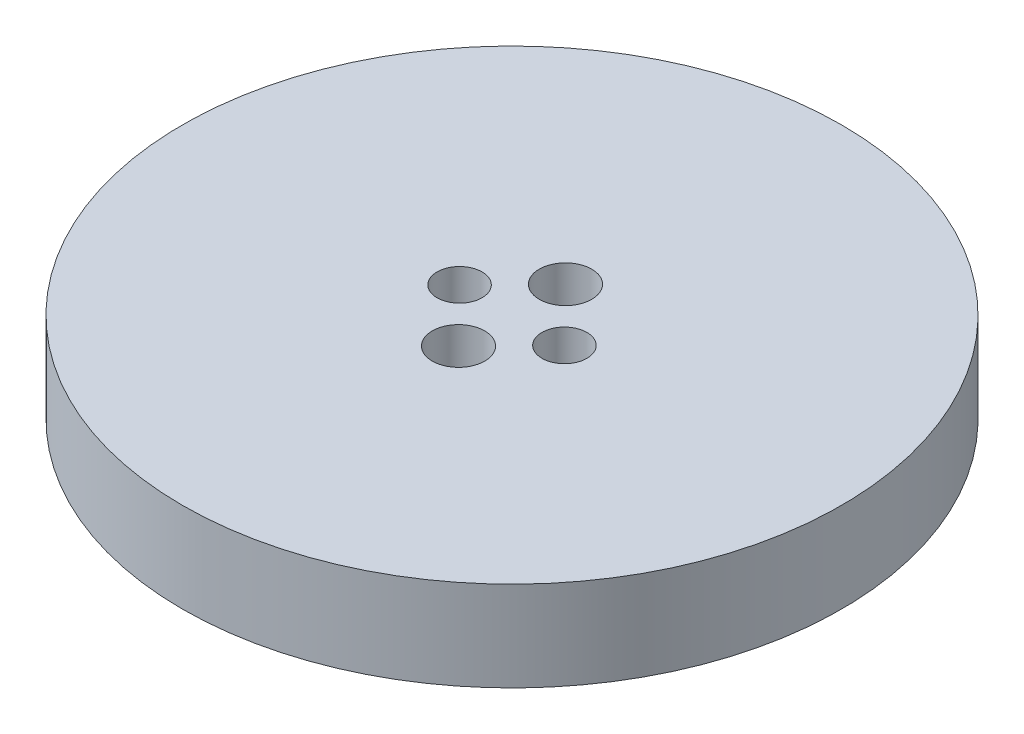
ISO-10303-21;
HEADER;
FILE_DESCRIPTION(('STEP AP214'),'2;1');
FILE_NAME('part.step','',(''),(''),'','','');
FILE_SCHEMA(('AUTOMOTIVE_DESIGN { 1 0 10303 214 1 1 1 1 }'));
ENDSEC;
DATA;
#1=APPLICATION_CONTEXT('core data for automotive mechanical design processes');
#2=APPLICATION_PROTOCOL_DEFINITION('international standard','automotive_design',2000,#1);
#3=PRODUCT_CONTEXT('',#1,'mechanical');
#4=PRODUCT('Part','Part','',(#3));
#5=PRODUCT_RELATED_PRODUCT_CATEGORY('part','',(#4));
#6=PRODUCT_DEFINITION_FORMATION('','',#4);
#7=PRODUCT_DEFINITION_CONTEXT('part definition',#1,'design');
#8=PRODUCT_DEFINITION('design','',#6,#7);
#9=PRODUCT_DEFINITION_SHAPE('','',#8);
#10=(LENGTH_UNIT() NAMED_UNIT(*) SI_UNIT(.MILLI.,.METRE.));
#11=(NAMED_UNIT(*) PLANE_ANGLE_UNIT() SI_UNIT($,.RADIAN.));
#12=(NAMED_UNIT(*) SI_UNIT($,.STERADIAN.) SOLID_ANGLE_UNIT());
#13=UNCERTAINTY_MEASURE_WITH_UNIT(LENGTH_MEASURE(1.E-05),#10,'distance_accuracy_value','');
#14=(GEOMETRIC_REPRESENTATION_CONTEXT(3) GLOBAL_UNCERTAINTY_ASSIGNED_CONTEXT((#13)) GLOBAL_UNIT_ASSIGNED_CONTEXT((#10,
#11,#12)) REPRESENTATION_CONTEXT('',''));
#15=CARTESIAN_POINT('',(0.,0.,0.));
#16=DIRECTION('',(0.,0.,1.));
#17=DIRECTION('',(1.,0.,0.));
#18=AXIS2_PLACEMENT_3D('',#15,#16,#17);
#19=CARTESIAN_POINT('',(0.,6.,0.));
#20=DIRECTION('',(0.,1.,0.));
#21=DIRECTION('',(0.,0.,1.));
#22=AXIS2_PLACEMENT_3D('',#19,#20,#21);
#23=PLANE('',#22);
#24=CARTESIAN_POINT('',(0.,6.,-3.57071421427143));
#25=DIRECTION('',(0.,1.,0.));
#26=DIRECTION('',(0.,0.,1.));
#27=AXIS2_PLACEMENT_3D('',#24,#25,#26);
#28=CIRCLE('',#27,1.75);
#29=CARTESIAN_POINT('',(0.,6.,-1.82071421427143));
#30=VERTEX_POINT('',#29);
#31=EDGE_CURVE('E53',#30,#30,#28,.T.);
#32=ORIENTED_EDGE('',*,*,#31,.F.);
#33=EDGE_LOOP('',(#32));
#34=FACE_BOUND('',#33,.T.);
#35=CARTESIAN_POINT('',(-3.5,6.,0.));
#36=DIRECTION('',(0.,1.,0.));
#37=DIRECTION('',(0.,0.,1.));
#38=AXIS2_PLACEMENT_3D('',#35,#36,#37);
#39=CIRCLE('',#38,1.5);
#40=CARTESIAN_POINT('',(-3.5,6.,1.5));
#41=VERTEX_POINT('',#40);
#42=EDGE_CURVE('E42',#41,#41,#39,.T.);
#43=ORIENTED_EDGE('',*,*,#42,.F.);
#44=EDGE_LOOP('',(#43));
#45=FACE_BOUND('',#44,.T.);
#46=CARTESIAN_POINT('',(0.,6.,0.));
#47=DIRECTION('',(0.,1.,0.));
#48=DIRECTION('',(0.,0.,1.));
#49=AXIS2_PLACEMENT_3D('',#46,#47,#48);
#50=CIRCLE('',#49,22.);
#51=CARTESIAN_POINT('',(0.,6.,22.));
#52=VERTEX_POINT('',#51);
#53=EDGE_CURVE('E10',#52,#52,#50,.T.);
#54=ORIENTED_EDGE('',*,*,#53,.T.);
#55=EDGE_LOOP('',(#54));
#56=FACE_BOUND('',#55,.T.);
#57=CARTESIAN_POINT('',(3.5,6.,0.));
#58=DIRECTION('',(0.,1.,0.));
#59=DIRECTION('',(0.,0.,1.));
#60=AXIS2_PLACEMENT_3D('',#57,#58,#59);
#61=CIRCLE('',#60,1.5);
#62=CARTESIAN_POINT('',(3.5,6.,1.5));
#63=VERTEX_POINT('',#62);
#64=EDGE_CURVE('E47',#63,#63,#61,.T.);
#65=ORIENTED_EDGE('',*,*,#64,.F.);
#66=EDGE_LOOP('',(#65));
#67=FACE_BOUND('',#66,.T.);
#68=CARTESIAN_POINT('',(0.,6.,3.57071421427143));
#69=DIRECTION('',(0.,1.,0.));
#70=DIRECTION('',(0.,0.,1.));
#71=AXIS2_PLACEMENT_3D('',#68,#69,#70);
#72=CIRCLE('',#71,1.75);
#73=CARTESIAN_POINT('',(0.,6.,5.32071421427143));
#74=VERTEX_POINT('',#73);
#75=EDGE_CURVE('E59',#74,#74,#72,.T.);
#76=ORIENTED_EDGE('',*,*,#75,.F.);
#77=EDGE_LOOP('',(#76));
#78=FACE_BOUND('',#77,.T.);
#79=ADVANCED_FACE('F31',(#34,#45,#56,#67,#78),#23,.T.);
#80=CARTESIAN_POINT('',(0.,0.,0.));
#81=DIRECTION('',(0.,1.,0.));
#82=DIRECTION('',(0.,0.,1.));
#83=AXIS2_PLACEMENT_3D('',#80,#81,#82);
#84=PLANE('',#83);
#85=CARTESIAN_POINT('',(0.,0.,0.));
#86=DIRECTION('',(0.,1.,0.));
#87=DIRECTION('',(0.,0.,1.));
#88=AXIS2_PLACEMENT_3D('',#85,#86,#87);
#89=CIRCLE('',#88,22.);
#90=CARTESIAN_POINT('',(0.,0.,22.));
#91=VERTEX_POINT('',#90);
#92=EDGE_CURVE('E35',#91,#91,#89,.T.);
#93=ORIENTED_EDGE('',*,*,#92,.F.);
#94=EDGE_LOOP('',(#93));
#95=FACE_BOUND('',#94,.T.);
#96=CARTESIAN_POINT('',(-3.5,0.,0.));
#97=DIRECTION('',(0.,1.,0.));
#98=DIRECTION('',(0.,0.,1.));
#99=AXIS2_PLACEMENT_3D('',#96,#97,#98);
#100=CIRCLE('',#99,1.5);
#101=CARTESIAN_POINT('',(-3.5,0.,1.5));
#102=VERTEX_POINT('',#101);
#103=EDGE_CURVE('E44',#102,#102,#100,.T.);
#104=ORIENTED_EDGE('',*,*,#103,.T.);
#105=EDGE_LOOP('',(#104));
#106=FACE_BOUND('',#105,.T.);
#107=CARTESIAN_POINT('',(3.5,0.,0.));
#108=DIRECTION('',(0.,1.,0.));
#109=DIRECTION('',(0.,0.,1.));
#110=AXIS2_PLACEMENT_3D('',#107,#108,#109);
#111=CIRCLE('',#110,1.5);
#112=CARTESIAN_POINT('',(3.5,0.,1.5));
#113=VERTEX_POINT('',#112);
#114=EDGE_CURVE('E50',#113,#113,#111,.T.);
#115=ORIENTED_EDGE('',*,*,#114,.T.);
#116=EDGE_LOOP('',(#115));
#117=FACE_BOUND('',#116,.T.);
#118=CARTESIAN_POINT('',(0.,0.,-3.57071421427143));
#119=DIRECTION('',(0.,1.,0.));
#120=DIRECTION('',(0.,0.,1.));
#121=AXIS2_PLACEMENT_3D('',#118,#119,#120);
#122=CIRCLE('',#121,1.75);
#123=CARTESIAN_POINT('',(0.,0.,-1.82071421427143));
#124=VERTEX_POINT('',#123);
#125=EDGE_CURVE('E56',#124,#124,#122,.T.);
#126=ORIENTED_EDGE('',*,*,#125,.T.);
#127=EDGE_LOOP('',(#126));
#128=FACE_BOUND('',#127,.T.);
#129=CARTESIAN_POINT('',(0.,0.,3.57071421427143));
#130=DIRECTION('',(0.,1.,0.));
#131=DIRECTION('',(0.,0.,1.));
#132=AXIS2_PLACEMENT_3D('',#129,#130,#131);
#133=CIRCLE('',#132,1.75);
#134=CARTESIAN_POINT('',(0.,0.,5.32071421427143));
#135=VERTEX_POINT('',#134);
#136=EDGE_CURVE('E62',#135,#135,#133,.T.);
#137=ORIENTED_EDGE('',*,*,#136,.T.);
#138=EDGE_LOOP('',(#137));
#139=FACE_BOUND('',#138,.T.);
#140=ADVANCED_FACE('F72',(#95,#106,#117,#128,#139),#84,.F.);
#141=CARTESIAN_POINT('',(0.,6.,0.));
#142=DIRECTION('',(0.,-1.,0.));
#143=DIRECTION('',(0.,0.,-1.));
#144=AXIS2_PLACEMENT_3D('',#141,#142,#143);
#145=CYLINDRICAL_SURFACE('',#144,22.);
#146=ORIENTED_EDGE('',*,*,#53,.F.);
#147=EDGE_LOOP('',(#146));
#148=FACE_BOUND('',#147,.T.);
#149=ORIENTED_EDGE('',*,*,#92,.T.);
#150=EDGE_LOOP('',(#149));
#151=FACE_BOUND('',#150,.T.);
#152=ADVANCED_FACE('F33',(#148,#151),#145,.T.);
#153=CARTESIAN_POINT('',(-3.5,6.,0.));
#154=DIRECTION('',(0.,-1.,0.));
#155=DIRECTION('',(0.,0.,-1.));
#156=AXIS2_PLACEMENT_3D('',#153,#154,#155);
#157=CYLINDRICAL_SURFACE('',#156,1.5);
#158=ORIENTED_EDGE('',*,*,#42,.T.);
#159=EDGE_LOOP('',(#158));
#160=FACE_BOUND('',#159,.T.);
#161=ORIENTED_EDGE('',*,*,#103,.F.);
#162=EDGE_LOOP('',(#161));
#163=FACE_BOUND('',#162,.T.);
#164=ADVANCED_FACE('F82',(#160,#163),#157,.F.);
#165=CARTESIAN_POINT('',(3.5,6.,0.));
#166=DIRECTION('',(0.,-1.,0.));
#167=DIRECTION('',(0.,0.,-1.));
#168=AXIS2_PLACEMENT_3D('',#165,#166,#167);
#169=CYLINDRICAL_SURFACE('',#168,1.5);
#170=ORIENTED_EDGE('',*,*,#64,.T.);
#171=EDGE_LOOP('',(#170));
#172=FACE_BOUND('',#171,.T.);
#173=ORIENTED_EDGE('',*,*,#114,.F.);
#174=EDGE_LOOP('',(#173));
#175=FACE_BOUND('',#174,.T.);
#176=ADVANCED_FACE('F85',(#172,#175),#169,.F.);
#177=CARTESIAN_POINT('',(0.,6.,-3.57071421427143));
#178=DIRECTION('',(0.,-1.,0.));
#179=DIRECTION('',(0.,0.,-1.));
#180=AXIS2_PLACEMENT_3D('',#177,#178,#179);
#181=CYLINDRICAL_SURFACE('',#180,1.75);
#182=ORIENTED_EDGE('',*,*,#31,.T.);
#183=EDGE_LOOP('',(#182));
#184=FACE_BOUND('',#183,.T.);
#185=ORIENTED_EDGE('',*,*,#125,.F.);
#186=EDGE_LOOP('',(#185));
#187=FACE_BOUND('',#186,.T.);
#188=ADVANCED_FACE('F89',(#184,#187),#181,.F.);
#189=CARTESIAN_POINT('',(0.,6.,3.57071421427143));
#190=DIRECTION('',(0.,-1.,0.));
#191=DIRECTION('',(0.,0.,-1.));
#192=AXIS2_PLACEMENT_3D('',#189,#190,#191);
#193=CYLINDRICAL_SURFACE('',#192,1.75);
#194=ORIENTED_EDGE('',*,*,#75,.T.);
#195=EDGE_LOOP('',(#194));
#196=FACE_BOUND('',#195,.T.);
#197=ORIENTED_EDGE('',*,*,#136,.F.);
#198=EDGE_LOOP('',(#197));
#199=FACE_BOUND('',#198,.T.);
#200=ADVANCED_FACE('F68',(#196,#199),#193,.F.);
#201=CLOSED_SHELL('',(#79,#140,#152,#164,#176,#188,#200));
#202=MANIFOLD_SOLID_BREP('B2',#201);
#203=ADVANCED_BREP_SHAPE_REPRESENTATION('',(#18,#202),#14);
#204=SHAPE_DEFINITION_REPRESENTATION(#9,#203);
ENDSEC;
END-ISO-10303-21;
